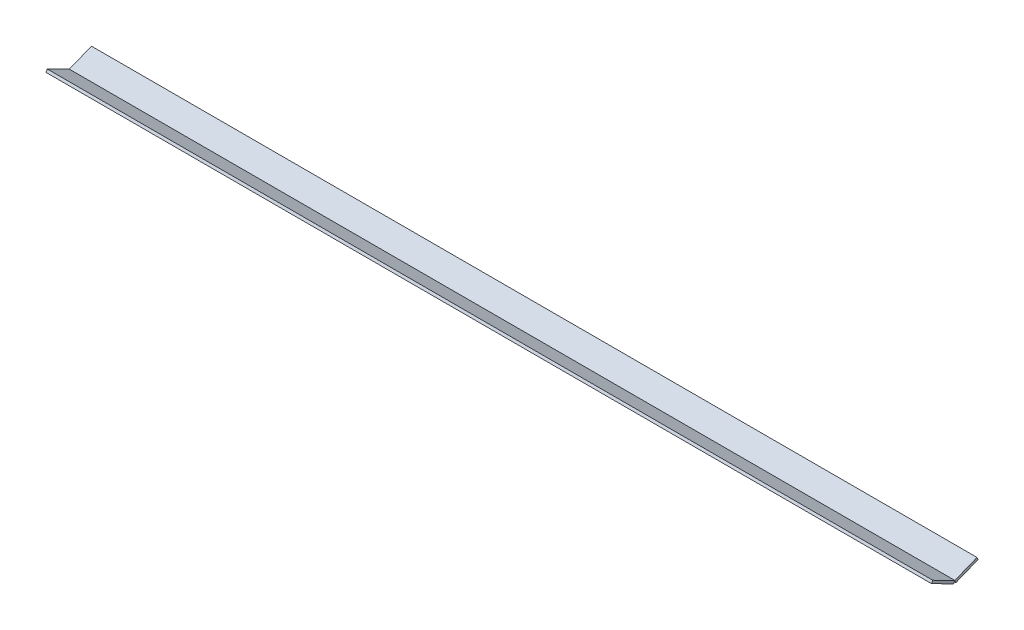
ISO-10303-21;
HEADER;
FILE_DESCRIPTION(('STEP AP214'),'2;1');
FILE_NAME('part.step','',(''),(''),'','','');
FILE_SCHEMA(('AUTOMOTIVE_DESIGN { 1 0 10303 214 1 1 1 1 }'));
ENDSEC;
DATA;
#1=APPLICATION_CONTEXT('core data for automotive mechanical design processes');
#2=APPLICATION_PROTOCOL_DEFINITION('international standard','automotive_design',2000,#1);
#3=PRODUCT_CONTEXT('',#1,'mechanical');
#4=PRODUCT('Part','Part','',(#3));
#5=PRODUCT_RELATED_PRODUCT_CATEGORY('part','',(#4));
#6=PRODUCT_DEFINITION_FORMATION('','',#4);
#7=PRODUCT_DEFINITION_CONTEXT('part definition',#1,'design');
#8=PRODUCT_DEFINITION('design','',#6,#7);
#9=PRODUCT_DEFINITION_SHAPE('','',#8);
#10=(LENGTH_UNIT() NAMED_UNIT(*) SI_UNIT(.MILLI.,.METRE.));
#11=(NAMED_UNIT(*) PLANE_ANGLE_UNIT() SI_UNIT($,.RADIAN.));
#12=(NAMED_UNIT(*) SI_UNIT($,.STERADIAN.) SOLID_ANGLE_UNIT());
#13=UNCERTAINTY_MEASURE_WITH_UNIT(LENGTH_MEASURE(1.E-05),#10,'distance_accuracy_value','');
#14=(GEOMETRIC_REPRESENTATION_CONTEXT(3) GLOBAL_UNCERTAINTY_ASSIGNED_CONTEXT((#13)) GLOBAL_UNIT_ASSIGNED_CONTEXT((#10,
#11,#12)) REPRESENTATION_CONTEXT('',''));
#15=CARTESIAN_POINT('',(0.,0.,0.));
#16=DIRECTION('',(0.,0.,1.));
#17=DIRECTION('',(1.,0.,0.));
#18=AXIS2_PLACEMENT_3D('',#15,#16,#17);
#19=CARTESIAN_POINT('',(1000.,10.,-25.));
#20=DIRECTION('',(0.,0.371390676354104,-0.928476690885259));
#21=DIRECTION('',(0.,0.928476690885259,0.371390676354104));
#22=AXIS2_PLACEMENT_3D('',#19,#20,#21);
#23=PLANE('',#22);
#24=DIRECTION('',(0.,-0.928476690885259,-0.371390676354104));
#25=VECTOR('',#24,1.);
#26=CARTESIAN_POINT('',(0.,10.,-25.));
#27=LINE('',#26,#25);
#28=CARTESIAN_POINT('',(0.,10.,-25.));
#29=VERTEX_POINT('',#28);
#30=CARTESIAN_POINT('',(0.,7.21456992734423,-26.1141720290623));
#31=VERTEX_POINT('',#30);
#32=EDGE_CURVE('E118',#29,#31,#27,.T.);
#33=ORIENTED_EDGE('',*,*,#32,.F.);
#34=DIRECTION('',(-1.,0.,0.));
#35=VECTOR('',#34,1.);
#36=CARTESIAN_POINT('',(1000.,10.,-25.));
#37=LINE('',#36,#35);
#38=CARTESIAN_POINT('',(1000.,10.,-25.));
#39=VERTEX_POINT('',#38);
#40=EDGE_CURVE('E12',#39,#29,#37,.T.);
#41=ORIENTED_EDGE('',*,*,#40,.F.);
#42=DIRECTION('',(0.,-0.928476690885259,-0.371390676354104));
#43=VECTOR('',#42,1.);
#44=CARTESIAN_POINT('',(1000.,10.,-25.));
#45=LINE('',#44,#43);
#46=CARTESIAN_POINT('',(1000.,7.21456992734423,-26.1141720290623));
#47=VERTEX_POINT('',#46);
#48=EDGE_CURVE('E110',#39,#47,#45,.T.);
#49=ORIENTED_EDGE('',*,*,#48,.T.);
#50=DIRECTION('',(-1.,0.,0.));
#51=VECTOR('',#50,1.);
#52=CARTESIAN_POINT('',(1000.,7.21456992734423,-26.1141720290623));
#53=LINE('',#52,#51);
#54=EDGE_CURVE('E71',#47,#31,#53,.T.);
#55=ORIENTED_EDGE('',*,*,#54,.T.);
#56=EDGE_LOOP('',(#33,#41,#49,#55));
#57=FACE_BOUND('',#56,.T.);
#58=ADVANCED_FACE('F55',(#57),#23,.T.);
#59=CARTESIAN_POINT('',(1000.,0.,0.));
#60=DIRECTION('',(0.,0.928476690885259,0.371390676354104));
#61=DIRECTION('',(0.,-0.371390676354104,0.928476690885259));
#62=AXIS2_PLACEMENT_3D('',#59,#60,#61);
#63=PLANE('',#62);
#64=DIRECTION('',(0.,0.371390676354104,-0.928476690885259));
#65=VECTOR('',#64,1.);
#66=CARTESIAN_POINT('',(0.,0.,0.));
#67=LINE('',#66,#65);
#68=CARTESIAN_POINT('',(0.,0.,0.));
#69=VERTEX_POINT('',#68);
#70=EDGE_CURVE('E101',#69,#29,#67,.T.);
#71=ORIENTED_EDGE('',*,*,#70,.F.);
#72=DIRECTION('',(-1.,0.,0.));
#73=VECTOR('',#72,1.);
#74=CARTESIAN_POINT('',(1000.,0.,0.));
#75=LINE('',#74,#73);
#76=CARTESIAN_POINT('',(1000.,0.,0.));
#77=VERTEX_POINT('',#76);
#78=EDGE_CURVE('E63',#77,#69,#75,.T.);
#79=ORIENTED_EDGE('',*,*,#78,.F.);
#80=DIRECTION('',(0.,0.371390676354104,-0.928476690885259));
#81=VECTOR('',#80,1.);
#82=CARTESIAN_POINT('',(1000.,0.,0.));
#83=LINE('',#82,#81);
#84=EDGE_CURVE('E99',#77,#39,#83,.T.);
#85=ORIENTED_EDGE('',*,*,#84,.T.);
#86=ORIENTED_EDGE('',*,*,#40,.T.);
#87=EDGE_LOOP('',(#71,#79,#85,#86));
#88=FACE_BOUND('',#87,.T.);
#89=ADVANCED_FACE('F98',(#88),#63,.T.);
#90=CARTESIAN_POINT('',(1000.,0.,0.));
#91=DIRECTION('',(0.,-0.371390676354104,0.928476690885259));
#92=DIRECTION('',(0.,-0.928476690885259,-0.371390676354104));
#93=AXIS2_PLACEMENT_3D('',#90,#91,#92);
#94=PLANE('',#93);
#95=DIRECTION('',(0.,0.928476690885259,0.371390676354104));
#96=VECTOR('',#95,1.);
#97=CARTESIAN_POINT('',(0.,0.,0.));
#98=LINE('',#97,#96);
#99=CARTESIAN_POINT('',(0.,-2.78543007265578,-1.11417202906231));
#100=VERTEX_POINT('',#99);
#101=EDGE_CURVE('E121',#100,#69,#98,.T.);
#102=ORIENTED_EDGE('',*,*,#101,.F.);
#103=DIRECTION('',(-1.,0.,0.));
#104=VECTOR('',#103,1.);
#105=CARTESIAN_POINT('',(1000.,-2.78543007265578,-1.11417202906231));
#106=LINE('',#105,#104);
#107=CARTESIAN_POINT('',(1000.,-2.78543007265578,-1.11417202906231));
#108=VERTEX_POINT('',#107);
#109=EDGE_CURVE('E84',#108,#100,#106,.T.);
#110=ORIENTED_EDGE('',*,*,#109,.F.);
#111=DIRECTION('',(0.,0.928476690885259,0.371390676354104));
#112=VECTOR('',#111,1.);
#113=CARTESIAN_POINT('',(1000.,0.,0.));
#114=LINE('',#113,#112);
#115=EDGE_CURVE('E109',#108,#77,#114,.T.);
#116=ORIENTED_EDGE('',*,*,#115,.T.);
#117=ORIENTED_EDGE('',*,*,#78,.T.);
#118=EDGE_LOOP('',(#102,#110,#116,#117));
#119=FACE_BOUND('',#118,.T.);
#120=ADVANCED_FACE('F112',(#119),#94,.T.);
#121=CARTESIAN_POINT('',(1000.,-2.78543007265578,-1.11417202906231));
#122=DIRECTION('',(0.,-0.928476690885259,-0.371390676354104));
#123=DIRECTION('',(0.,0.371390676354104,-0.928476690885259));
#124=AXIS2_PLACEMENT_3D('',#121,#122,#123);
#125=PLANE('',#124);
#126=DIRECTION('',(0.,-0.371390676354104,0.928476690885259));
#127=VECTOR('',#126,1.);
#128=CARTESIAN_POINT('',(0.,-2.78543007265578,-1.11417202906231));
#129=LINE('',#128,#127);
#130=EDGE_CURVE('E123',#31,#100,#129,.T.);
#131=ORIENTED_EDGE('',*,*,#130,.F.);
#132=ORIENTED_EDGE('',*,*,#54,.F.);
#133=DIRECTION('',(0.,-0.371390676354104,0.928476690885259));
#134=VECTOR('',#133,1.);
#135=CARTESIAN_POINT('',(1000.,-2.78543007265578,-1.11417202906231));
#136=LINE('',#135,#134);
#137=EDGE_CURVE('E113',#47,#108,#136,.T.);
#138=ORIENTED_EDGE('',*,*,#137,.T.);
#139=ORIENTED_EDGE('',*,*,#109,.T.);
#140=EDGE_LOOP('',(#131,#132,#138,#139));
#141=FACE_BOUND('',#140,.T.);
#142=ADVANCED_FACE('F128',(#141),#125,.T.);
#143=CARTESIAN_POINT('',(1000.,0.,0.));
#144=DIRECTION('',(1.,0.,0.));
#145=DIRECTION('',(0.,0.,-1.));
#146=AXIS2_PLACEMENT_3D('',#143,#144,#145);
#147=PLANE('',#146);
#148=ORIENTED_EDGE('',*,*,#48,.F.);
#149=ORIENTED_EDGE('',*,*,#84,.F.);
#150=ORIENTED_EDGE('',*,*,#115,.F.);
#151=ORIENTED_EDGE('',*,*,#137,.F.);
#152=EDGE_LOOP('',(#148,#149,#150,#151));
#153=FACE_BOUND('',#152,.T.);
#154=ADVANCED_FACE('F107',(#153),#147,.T.);
#155=CARTESIAN_POINT('',(0.,0.,0.));
#156=DIRECTION('',(1.,0.,0.));
#157=DIRECTION('',(0.,0.,-1.));
#158=AXIS2_PLACEMENT_3D('',#155,#156,#157);
#159=PLANE('',#158);
#160=ORIENTED_EDGE('',*,*,#32,.T.);
#161=ORIENTED_EDGE('',*,*,#130,.T.);
#162=ORIENTED_EDGE('',*,*,#101,.T.);
#163=ORIENTED_EDGE('',*,*,#70,.T.);
#164=EDGE_LOOP('',(#160,#161,#162,#163));
#165=FACE_BOUND('',#164,.T.);
#166=ADVANCED_FACE('F135',(#165),#159,.F.);
#167=CLOSED_SHELL('',(#58,#89,#120,#142,#154,#166));
#168=MANIFOLD_SOLID_BREP('B2',#167);
#169=CARTESIAN_POINT('',(1000.,-2.67571670247805,1.35666507586802));
#170=DIRECTION('',(0.,-0.891905567492684,0.452221691956007));
#171=DIRECTION('',(0.,-0.452221691956007,-0.891905567492684));
#172=AXIS2_PLACEMENT_3D('',#169,#170,#171);
#173=PLANE('',#172);
#174=DIRECTION('',(0.,0.452221691956007,0.891905567492684));
#175=VECTOR('',#174,1.);
#176=CARTESIAN_POINT('',(0.,-2.67571670247805,1.35666507586802));
#177=LINE('',#176,#175);
#178=CARTESIAN_POINT('',(0.,-2.67571670247805,1.35666507586802));
#179=VERTEX_POINT('',#178);
#180=CARTESIAN_POINT('',(0.,10.,26.356665075868));
#181=VERTEX_POINT('',#180);
#182=EDGE_CURVE('E247',#179,#181,#177,.T.);
#183=ORIENTED_EDGE('',*,*,#182,.F.);
#184=DIRECTION('',(-1.,0.,0.));
#185=VECTOR('',#184,1.);
#186=CARTESIAN_POINT('',(1000.,-2.67571670247805,1.35666507586802));
#187=LINE('',#186,#185);
#188=CARTESIAN_POINT('',(1000.,-2.67571670247805,1.35666507586802));
#189=VERTEX_POINT('',#188);
#190=EDGE_CURVE('E53',#189,#179,#187,.T.);
#191=ORIENTED_EDGE('',*,*,#190,.F.);
#192=DIRECTION('',(0.,0.452221691956007,0.891905567492684));
#193=VECTOR('',#192,1.);
#194=CARTESIAN_POINT('',(1000.,-2.67571670247805,1.35666507586802));
#195=LINE('',#194,#193);
#196=CARTESIAN_POINT('',(1000.,10.,26.356665075868));
#197=VERTEX_POINT('',#196);
#198=EDGE_CURVE('E236',#189,#197,#195,.T.);
#199=ORIENTED_EDGE('',*,*,#198,.T.);
#200=DIRECTION('',(-1.,0.,0.));
#201=VECTOR('',#200,1.);
#202=CARTESIAN_POINT('',(1000.,10.,26.356665075868));
#203=LINE('',#202,#201);
#204=EDGE_CURVE('E196',#197,#181,#203,.T.);
#205=ORIENTED_EDGE('',*,*,#204,.T.);
#206=EDGE_LOOP('',(#183,#191,#199,#205));
#207=FACE_BOUND('',#206,.T.);
#208=ADVANCED_FACE('F179',(#207),#173,.T.);
#209=CARTESIAN_POINT('',(1000.,0.,0.));
#210=DIRECTION('',(0.,-0.452221691956007,-0.891905567492684));
#211=DIRECTION('',(0.,0.891905567492684,-0.452221691956007));
#212=AXIS2_PLACEMENT_3D('',#209,#210,#211);
#213=PLANE('',#212);
#214=DIRECTION('',(0.,-0.891905567492684,0.452221691956007));
#215=VECTOR('',#214,1.);
#216=CARTESIAN_POINT('',(0.,0.,0.));
#217=LINE('',#216,#215);
#218=CARTESIAN_POINT('',(0.,0.,0.));
#219=VERTEX_POINT('',#218);
#220=EDGE_CURVE('E226',#219,#179,#217,.T.);
#221=ORIENTED_EDGE('',*,*,#220,.F.);
#222=DIRECTION('',(-1.,0.,0.));
#223=VECTOR('',#222,1.);
#224=CARTESIAN_POINT('',(1000.,0.,0.));
#225=LINE('',#224,#223);
#226=CARTESIAN_POINT('',(1000.,0.,0.));
#227=VERTEX_POINT('',#226);
#228=EDGE_CURVE('E188',#227,#219,#225,.T.);
#229=ORIENTED_EDGE('',*,*,#228,.F.);
#230=DIRECTION('',(0.,-0.891905567492684,0.452221691956007));
#231=VECTOR('',#230,1.);
#232=CARTESIAN_POINT('',(1000.,0.,0.));
#233=LINE('',#232,#231);
#234=EDGE_CURVE('E224',#227,#189,#233,.T.);
#235=ORIENTED_EDGE('',*,*,#234,.T.);
#236=ORIENTED_EDGE('',*,*,#190,.T.);
#237=EDGE_LOOP('',(#221,#229,#235,#236));
#238=FACE_BOUND('',#237,.T.);
#239=ADVANCED_FACE('F223',(#238),#213,.T.);
#240=CARTESIAN_POINT('',(1000.,0.,0.));
#241=DIRECTION('',(0.,0.891905567492684,-0.452221691956007));
#242=DIRECTION('',(0.,0.452221691956007,0.891905567492684));
#243=AXIS2_PLACEMENT_3D('',#240,#241,#242);
#244=PLANE('',#243);
#245=DIRECTION('',(0.,-0.452221691956007,-0.891905567492684));
#246=VECTOR('',#245,1.);
#247=CARTESIAN_POINT('',(0.,0.,0.));
#248=LINE('',#247,#246);
#249=CARTESIAN_POINT('',(0.,12.6757167024781,25.));
#250=VERTEX_POINT('',#249);
#251=EDGE_CURVE('E252',#250,#219,#248,.T.);
#252=ORIENTED_EDGE('',*,*,#251,.F.);
#253=DIRECTION('',(-1.,0.,0.));
#254=VECTOR('',#253,1.);
#255=CARTESIAN_POINT('',(1000.,12.6757167024781,25.));
#256=LINE('',#255,#254);
#257=CARTESIAN_POINT('',(1000.,12.6757167024781,25.));
#258=VERTEX_POINT('',#257);
#259=EDGE_CURVE('E209',#258,#250,#256,.T.);
#260=ORIENTED_EDGE('',*,*,#259,.F.);
#261=DIRECTION('',(0.,-0.452221691956007,-0.891905567492684));
#262=VECTOR('',#261,1.);
#263=CARTESIAN_POINT('',(1000.,0.,0.));
#264=LINE('',#263,#262);
#265=EDGE_CURVE('E235',#258,#227,#264,.T.);
#266=ORIENTED_EDGE('',*,*,#265,.T.);
#267=ORIENTED_EDGE('',*,*,#228,.T.);
#268=EDGE_LOOP('',(#252,#260,#266,#267));
#269=FACE_BOUND('',#268,.T.);
#270=ADVANCED_FACE('F239',(#269),#244,.T.);
#271=CARTESIAN_POINT('',(1000.,12.675716702478,25.));
#272=DIRECTION('',(0.,0.452221691956007,0.891905567492684));
#273=DIRECTION('',(0.,-0.891905567492684,0.452221691956007));
#274=AXIS2_PLACEMENT_3D('',#271,#272,#273);
#275=PLANE('',#274);
#276=DIRECTION('',(0.,0.891905567492684,-0.452221691956007));
#277=VECTOR('',#276,1.);
#278=CARTESIAN_POINT('',(0.,12.675716702478,25.));
#279=LINE('',#278,#277);
#280=EDGE_CURVE('E255',#181,#250,#279,.T.);
#281=ORIENTED_EDGE('',*,*,#280,.F.);
#282=ORIENTED_EDGE('',*,*,#204,.F.);
#283=DIRECTION('',(0.,0.891905567492684,-0.452221691956007));
#284=VECTOR('',#283,1.);
#285=CARTESIAN_POINT('',(1000.,12.675716702478,25.));
#286=LINE('',#285,#284);
#287=EDGE_CURVE('E241',#197,#258,#286,.T.);
#288=ORIENTED_EDGE('',*,*,#287,.T.);
#289=ORIENTED_EDGE('',*,*,#259,.T.);
#290=EDGE_LOOP('',(#281,#282,#288,#289));
#291=FACE_BOUND('',#290,.T.);
#292=ADVANCED_FACE('F264',(#291),#275,.T.);
#293=CARTESIAN_POINT('',(1000.,0.,0.));
#294=DIRECTION('',(1.,0.,0.));
#295=DIRECTION('',(0.,0.,-1.));
#296=AXIS2_PLACEMENT_3D('',#293,#294,#295);
#297=PLANE('',#296);
#298=ORIENTED_EDGE('',*,*,#198,.F.);
#299=ORIENTED_EDGE('',*,*,#234,.F.);
#300=ORIENTED_EDGE('',*,*,#265,.F.);
#301=ORIENTED_EDGE('',*,*,#287,.F.);
#302=EDGE_LOOP('',(#298,#299,#300,#301));
#303=FACE_BOUND('',#302,.T.);
#304=ADVANCED_FACE('F233',(#303),#297,.T.);
#305=CARTESIAN_POINT('',(0.,0.,0.));
#306=DIRECTION('',(1.,0.,0.));
#307=DIRECTION('',(0.,0.,-1.));
#308=AXIS2_PLACEMENT_3D('',#305,#306,#307);
#309=PLANE('',#308);
#310=ORIENTED_EDGE('',*,*,#182,.T.);
#311=ORIENTED_EDGE('',*,*,#280,.T.);
#312=ORIENTED_EDGE('',*,*,#251,.T.);
#313=ORIENTED_EDGE('',*,*,#220,.T.);
#314=EDGE_LOOP('',(#310,#311,#312,#313));
#315=FACE_BOUND('',#314,.T.);
#316=ADVANCED_FACE('F271',(#315),#309,.F.);
#317=CLOSED_SHELL('',(#208,#239,#270,#292,#304,#316));
#318=MANIFOLD_SOLID_BREP('B6',#317);
#319=ADVANCED_BREP_SHAPE_REPRESENTATION('',(#18,#168,#318),#14);
#320=SHAPE_DEFINITION_REPRESENTATION(#9,#319);
ENDSEC;
END-ISO-10303-21;
